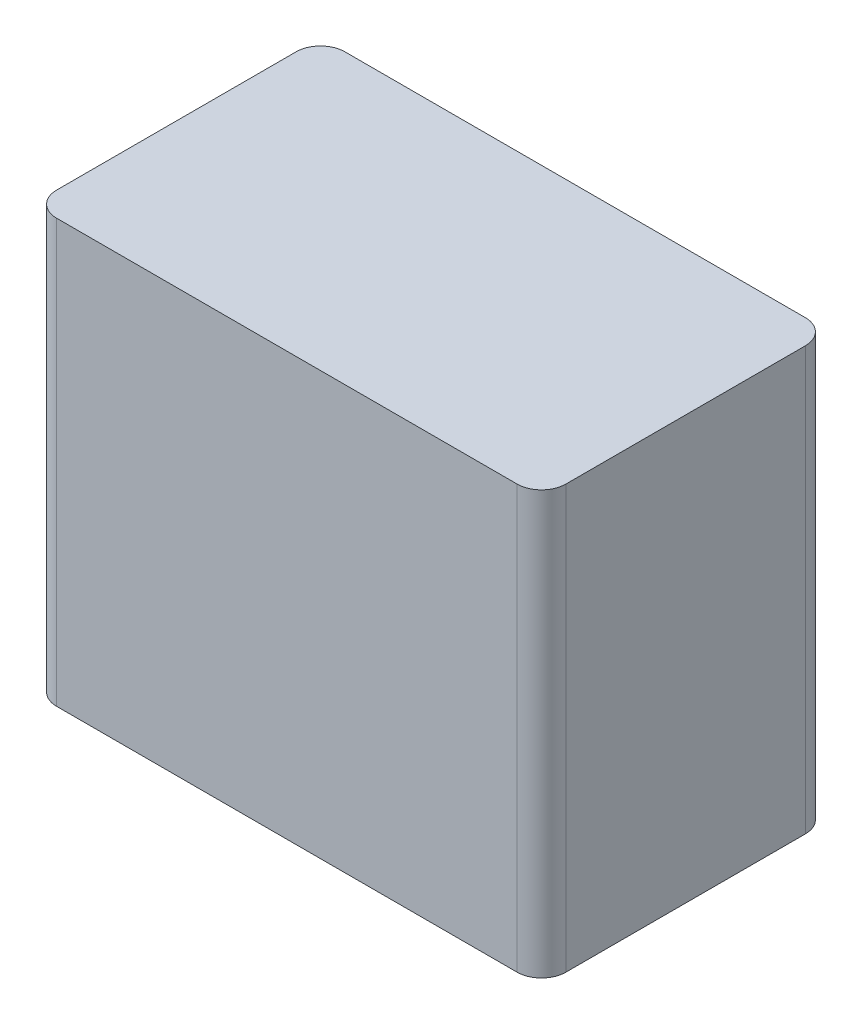
ISO-10303-21;
HEADER;
FILE_DESCRIPTION(('STEP AP214'),'2;1');
FILE_NAME('part.step','',(''),(''),'','','');
FILE_SCHEMA(('AUTOMOTIVE_DESIGN { 1 0 10303 214 1 1 1 1 }'));
ENDSEC;
DATA;
#1=APPLICATION_CONTEXT('core data for automotive mechanical design processes');
#2=APPLICATION_PROTOCOL_DEFINITION('international standard','automotive_design',2000,#1);
#3=PRODUCT_CONTEXT('',#1,'mechanical');
#4=PRODUCT('Part','Part','',(#3));
#5=PRODUCT_RELATED_PRODUCT_CATEGORY('part','',(#4));
#6=PRODUCT_DEFINITION_FORMATION('','',#4);
#7=PRODUCT_DEFINITION_CONTEXT('part definition',#1,'design');
#8=PRODUCT_DEFINITION('design','',#6,#7);
#9=PRODUCT_DEFINITION_SHAPE('','',#8);
#10=(LENGTH_UNIT() NAMED_UNIT(*) SI_UNIT(.MILLI.,.METRE.));
#11=(NAMED_UNIT(*) PLANE_ANGLE_UNIT() SI_UNIT($,.RADIAN.));
#12=(NAMED_UNIT(*) SI_UNIT($,.STERADIAN.) SOLID_ANGLE_UNIT());
#13=UNCERTAINTY_MEASURE_WITH_UNIT(LENGTH_MEASURE(1.E-05),#10,'distance_accuracy_value','');
#14=(GEOMETRIC_REPRESENTATION_CONTEXT(3) GLOBAL_UNCERTAINTY_ASSIGNED_CONTEXT((#13)) GLOBAL_UNIT_ASSIGNED_CONTEXT((#10,
#11,#12)) REPRESENTATION_CONTEXT('',''));
#15=CARTESIAN_POINT('',(0.,0.,0.));
#16=DIRECTION('',(0.,0.,1.));
#17=DIRECTION('',(1.,0.,0.));
#18=AXIS2_PLACEMENT_3D('',#15,#16,#17);
#19=CARTESIAN_POINT('',(0.,0.,30.));
#20=DIRECTION('',(-1.,0.,0.));
#21=DIRECTION('',(0.,0.,1.));
#22=AXIS2_PLACEMENT_3D('',#19,#20,#21);
#23=PLANE('',#22);
#24=DIRECTION('',(0.,0.,-1.));
#25=VECTOR('',#24,1.);
#26=CARTESIAN_POINT('',(0.,0.,30.));
#27=LINE('',#26,#25);
#28=CARTESIAN_POINT('',(0.,0.,27.46));
#29=VERTEX_POINT('',#28);
#30=CARTESIAN_POINT('',(0.,0.,2.54));
#31=VERTEX_POINT('',#30);
#32=EDGE_CURVE('E121',#29,#31,#27,.T.);
#33=ORIENTED_EDGE('',*,*,#32,.T.);
#34=DIRECTION('',(0.,1.,0.));
#35=VECTOR('',#34,1.);
#36=CARTESIAN_POINT('',(0.,0.,2.54));
#37=LINE('',#36,#35);
#38=CARTESIAN_POINT('',(0.,44.,2.54));
#39=VERTEX_POINT('',#38);
#40=EDGE_CURVE('E11',#31,#39,#37,.T.);
#41=ORIENTED_EDGE('',*,*,#40,.T.);
#42=DIRECTION('',(0.,0.,-1.));
#43=VECTOR('',#42,1.);
#44=CARTESIAN_POINT('',(0.,44.,30.));
#45=LINE('',#44,#43);
#46=CARTESIAN_POINT('',(0.,44.,27.46));
#47=VERTEX_POINT('',#46);
#48=EDGE_CURVE('E126',#47,#39,#45,.T.);
#49=ORIENTED_EDGE('',*,*,#48,.F.);
#50=DIRECTION('',(0.,1.,0.));
#51=VECTOR('',#50,1.);
#52=CARTESIAN_POINT('',(0.,0.,27.46));
#53=LINE('',#52,#51);
#54=EDGE_CURVE('E41',#47,#29,#53,.F.);
#55=ORIENTED_EDGE('',*,*,#54,.T.);
#56=EDGE_LOOP('',(#33,#41,#49,#55));
#57=FACE_BOUND('',#56,.T.);
#58=ADVANCED_FACE('F33',(#57),#23,.F.);
#59=CARTESIAN_POINT('',(0.,44.,30.));
#60=DIRECTION('',(0.,-1.,0.));
#61=DIRECTION('',(1.,0.,0.));
#62=AXIS2_PLACEMENT_3D('',#59,#60,#61);
#63=PLANE('',#62);
#64=DIRECTION('',(-1.,0.,0.));
#65=VECTOR('',#64,1.);
#66=CARTESIAN_POINT('',(0.,44.,0.));
#67=LINE('',#66,#65);
#68=CARTESIAN_POINT('',(-2.54,44.,0.));
#69=VERTEX_POINT('',#68);
#70=CARTESIAN_POINT('',(-50.46,44.,0.));
#71=VERTEX_POINT('',#70);
#72=EDGE_CURVE('E168',#69,#71,#67,.T.);
#73=ORIENTED_EDGE('',*,*,#72,.T.);
#74=CARTESIAN_POINT('',(-50.46,44.,2.54));
#75=DIRECTION('',(0.,-1.,0.));
#76=DIRECTION('',(1.,0.,0.));
#77=AXIS2_PLACEMENT_3D('',#74,#75,#76);
#78=CIRCLE('',#77,2.54);
#79=CARTESIAN_POINT('',(-53.,44.,2.54));
#80=VERTEX_POINT('',#79);
#81=EDGE_CURVE('E143',#71,#80,#78,.F.);
#82=ORIENTED_EDGE('',*,*,#81,.T.);
#83=DIRECTION('',(0.,0.,-1.));
#84=VECTOR('',#83,1.);
#85=CARTESIAN_POINT('',(-53.,44.,30.));
#86=LINE('',#85,#84);
#87=CARTESIAN_POINT('',(-53.,44.,27.46));
#88=VERTEX_POINT('',#87);
#89=EDGE_CURVE('E120',#88,#80,#86,.T.);
#90=ORIENTED_EDGE('',*,*,#89,.F.);
#91=CARTESIAN_POINT('',(-50.46,44.,27.46));
#92=DIRECTION('',(0.,-1.,0.));
#93=DIRECTION('',(1.,0.,0.));
#94=AXIS2_PLACEMENT_3D('',#91,#92,#93);
#95=CIRCLE('',#94,2.54);
#96=CARTESIAN_POINT('',(-50.46,44.,30.));
#97=VERTEX_POINT('',#96);
#98=EDGE_CURVE('E125',#88,#97,#95,.F.);
#99=ORIENTED_EDGE('',*,*,#98,.T.);
#100=DIRECTION('',(-1.,0.,0.));
#101=VECTOR('',#100,1.);
#102=CARTESIAN_POINT('',(0.,44.,30.));
#103=LINE('',#102,#101);
#104=CARTESIAN_POINT('',(-2.54,44.,30.));
#105=VERTEX_POINT('',#104);
#106=EDGE_CURVE('E162',#105,#97,#103,.T.);
#107=ORIENTED_EDGE('',*,*,#106,.F.);
#108=CARTESIAN_POINT('',(-2.54,44.,27.46));
#109=DIRECTION('',(0.,-1.,0.));
#110=DIRECTION('',(1.,0.,0.));
#111=AXIS2_PLACEMENT_3D('',#108,#109,#110);
#112=CIRCLE('',#111,2.54);
#113=EDGE_CURVE('E55',#105,#47,#112,.F.);
#114=ORIENTED_EDGE('',*,*,#113,.T.);
#115=ORIENTED_EDGE('',*,*,#48,.T.);
#116=CARTESIAN_POINT('',(-2.54,44.,2.54));
#117=DIRECTION('',(0.,-1.,0.));
#118=DIRECTION('',(1.,0.,0.));
#119=AXIS2_PLACEMENT_3D('',#116,#117,#118);
#120=CIRCLE('',#119,2.54);
#121=EDGE_CURVE('E48',#39,#69,#120,.F.);
#122=ORIENTED_EDGE('',*,*,#121,.T.);
#123=EDGE_LOOP('',(#73,#82,#90,#99,#107,#114,#115,#122));
#124=FACE_BOUND('',#123,.T.);
#125=ADVANCED_FACE('F164',(#124),#63,.F.);
#126=CARTESIAN_POINT('',(-53.,0.,30.));
#127=DIRECTION('',(1.,0.,0.));
#128=DIRECTION('',(0.,0.,-1.));
#129=AXIS2_PLACEMENT_3D('',#126,#127,#128);
#130=PLANE('',#129);
#131=ORIENTED_EDGE('',*,*,#89,.T.);
#132=DIRECTION('',(0.,-1.,0.));
#133=VECTOR('',#132,1.);
#134=CARTESIAN_POINT('',(-53.,0.,2.54));
#135=LINE('',#134,#133);
#136=CARTESIAN_POINT('',(-53.,0.,2.54));
#137=VERTEX_POINT('',#136);
#138=EDGE_CURVE('E119',#80,#137,#135,.T.);
#139=ORIENTED_EDGE('',*,*,#138,.T.);
#140=DIRECTION('',(0.,0.,-1.));
#141=VECTOR('',#140,1.);
#142=CARTESIAN_POINT('',(-53.,0.,30.));
#143=LINE('',#142,#141);
#144=CARTESIAN_POINT('',(-53.,0.,27.46));
#145=VERTEX_POINT('',#144);
#146=EDGE_CURVE('E102',#145,#137,#143,.T.);
#147=ORIENTED_EDGE('',*,*,#146,.F.);
#148=DIRECTION('',(0.,-1.,0.));
#149=VECTOR('',#148,1.);
#150=CARTESIAN_POINT('',(-53.,44.,27.46));
#151=LINE('',#150,#149);
#152=EDGE_CURVE('E116',#145,#88,#151,.F.);
#153=ORIENTED_EDGE('',*,*,#152,.T.);
#154=EDGE_LOOP('',(#131,#139,#147,#153));
#155=FACE_BOUND('',#154,.T.);
#156=ADVANCED_FACE('F115',(#155),#130,.F.);
#157=CARTESIAN_POINT('',(0.,0.,30.));
#158=DIRECTION('',(0.,1.,0.));
#159=DIRECTION('',(0.,0.,1.));
#160=AXIS2_PLACEMENT_3D('',#157,#158,#159);
#161=PLANE('',#160);
#162=ORIENTED_EDGE('',*,*,#146,.T.);
#163=CARTESIAN_POINT('',(-50.46,0.,2.54));
#164=DIRECTION('',(0.,1.,0.));
#165=DIRECTION('',(0.,0.,1.));
#166=AXIS2_PLACEMENT_3D('',#163,#164,#165);
#167=CIRCLE('',#166,2.54);
#168=CARTESIAN_POINT('',(-50.46,0.,0.));
#169=VERTEX_POINT('',#168);
#170=EDGE_CURVE('E109',#137,#169,#167,.F.);
#171=ORIENTED_EDGE('',*,*,#170,.T.);
#172=DIRECTION('',(1.,0.,0.));
#173=VECTOR('',#172,1.);
#174=CARTESIAN_POINT('',(0.,0.,0.));
#175=LINE('',#174,#173);
#176=CARTESIAN_POINT('',(-2.54,0.,0.));
#177=VERTEX_POINT('',#176);
#178=EDGE_CURVE('E165',#169,#177,#175,.T.);
#179=ORIENTED_EDGE('',*,*,#178,.T.);
#180=CARTESIAN_POINT('',(-2.54,0.,2.54));
#181=DIRECTION('',(0.,1.,0.));
#182=DIRECTION('',(0.,0.,1.));
#183=AXIS2_PLACEMENT_3D('',#180,#181,#182);
#184=CIRCLE('',#183,2.54);
#185=EDGE_CURVE('E110',#177,#31,#184,.F.);
#186=ORIENTED_EDGE('',*,*,#185,.T.);
#187=ORIENTED_EDGE('',*,*,#32,.F.);
#188=CARTESIAN_POINT('',(-2.54,0.,27.46));
#189=DIRECTION('',(0.,1.,0.));
#190=DIRECTION('',(0.,0.,1.));
#191=AXIS2_PLACEMENT_3D('',#188,#189,#190);
#192=CIRCLE('',#191,2.54);
#193=CARTESIAN_POINT('',(-2.54,0.,30.));
#194=VERTEX_POINT('',#193);
#195=EDGE_CURVE('E128',#29,#194,#192,.F.);
#196=ORIENTED_EDGE('',*,*,#195,.T.);
#197=DIRECTION('',(1.,0.,0.));
#198=VECTOR('',#197,1.);
#199=CARTESIAN_POINT('',(0.,0.,30.));
#200=LINE('',#199,#198);
#201=CARTESIAN_POINT('',(-50.46,0.,30.));
#202=VERTEX_POINT('',#201);
#203=EDGE_CURVE('E104',#202,#194,#200,.T.);
#204=ORIENTED_EDGE('',*,*,#203,.F.);
#205=CARTESIAN_POINT('',(-50.46,0.,27.46));
#206=DIRECTION('',(0.,1.,0.));
#207=DIRECTION('',(0.,0.,1.));
#208=AXIS2_PLACEMENT_3D('',#205,#206,#207);
#209=CIRCLE('',#208,2.54);
#210=EDGE_CURVE('E99',#202,#145,#209,.F.);
#211=ORIENTED_EDGE('',*,*,#210,.T.);
#212=EDGE_LOOP('',(#162,#171,#179,#186,#187,#196,#204,#211));
#213=FACE_BOUND('',#212,.T.);
#214=ADVANCED_FACE('F101',(#213),#161,.F.);
#215=CARTESIAN_POINT('',(0.,0.,30.));
#216=DIRECTION('',(0.,0.,1.));
#217=DIRECTION('',(1.,0.,0.));
#218=AXIS2_PLACEMENT_3D('',#215,#216,#217);
#219=PLANE('',#218);
#220=ORIENTED_EDGE('',*,*,#106,.T.);
#221=DIRECTION('',(0.,-1.,0.));
#222=VECTOR('',#221,1.);
#223=CARTESIAN_POINT('',(-50.46,0.,30.));
#224=LINE('',#223,#222);
#225=EDGE_CURVE('E148',#97,#202,#224,.T.);
#226=ORIENTED_EDGE('',*,*,#225,.T.);
#227=ORIENTED_EDGE('',*,*,#203,.T.);
#228=DIRECTION('',(0.,1.,0.));
#229=VECTOR('',#228,1.);
#230=CARTESIAN_POINT('',(-2.54,44.,30.));
#231=LINE('',#230,#229);
#232=EDGE_CURVE('E145',#194,#105,#231,.T.);
#233=ORIENTED_EDGE('',*,*,#232,.T.);
#234=EDGE_LOOP('',(#220,#226,#227,#233));
#235=FACE_BOUND('',#234,.T.);
#236=ADVANCED_FACE('F161',(#235),#219,.T.);
#237=CARTESIAN_POINT('',(0.,0.,0.));
#238=DIRECTION('',(0.,0.,1.));
#239=DIRECTION('',(1.,0.,0.));
#240=AXIS2_PLACEMENT_3D('',#237,#238,#239);
#241=PLANE('',#240);
#242=ORIENTED_EDGE('',*,*,#178,.F.);
#243=DIRECTION('',(0.,-1.,0.));
#244=VECTOR('',#243,1.);
#245=CARTESIAN_POINT('',(-50.46,0.,0.));
#246=LINE('',#245,#244);
#247=EDGE_CURVE('E138',#169,#71,#246,.F.);
#248=ORIENTED_EDGE('',*,*,#247,.T.);
#249=ORIENTED_EDGE('',*,*,#72,.F.);
#250=DIRECTION('',(0.,1.,0.));
#251=VECTOR('',#250,1.);
#252=CARTESIAN_POINT('',(-2.54,0.,0.));
#253=LINE('',#252,#251);
#254=EDGE_CURVE('E136',#69,#177,#253,.F.);
#255=ORIENTED_EDGE('',*,*,#254,.T.);
#256=EDGE_LOOP('',(#242,#248,#249,#255));
#257=FACE_BOUND('',#256,.T.);
#258=ADVANCED_FACE('F177',(#257),#241,.F.);
#259=CARTESIAN_POINT('',(-50.46,0.,2.54));
#260=DIRECTION('',(0.,-1.,0.));
#261=DIRECTION('',(0.,0.,-1.));
#262=AXIS2_PLACEMENT_3D('',#259,#260,#261);
#263=CYLINDRICAL_SURFACE('',#262,2.54);
#264=ORIENTED_EDGE('',*,*,#81,.F.);
#265=ORIENTED_EDGE('',*,*,#247,.F.);
#266=ORIENTED_EDGE('',*,*,#170,.F.);
#267=ORIENTED_EDGE('',*,*,#138,.F.);
#268=EDGE_LOOP('',(#264,#265,#266,#267));
#269=FACE_BOUND('',#268,.T.);
#270=ADVANCED_FACE('F173',(#269),#263,.T.);
#271=CARTESIAN_POINT('',(-50.46,0.,27.46));
#272=DIRECTION('',(0.,1.,0.));
#273=DIRECTION('',(0.,0.,1.));
#274=AXIS2_PLACEMENT_3D('',#271,#272,#273);
#275=CYLINDRICAL_SURFACE('',#274,2.54);
#276=ORIENTED_EDGE('',*,*,#98,.F.);
#277=ORIENTED_EDGE('',*,*,#152,.F.);
#278=ORIENTED_EDGE('',*,*,#210,.F.);
#279=ORIENTED_EDGE('',*,*,#225,.F.);
#280=EDGE_LOOP('',(#276,#277,#278,#279));
#281=FACE_BOUND('',#280,.T.);
#282=ADVANCED_FACE('F124',(#281),#275,.T.);
#283=CARTESIAN_POINT('',(-2.54,0.,2.54));
#284=DIRECTION('',(0.,1.,0.));
#285=DIRECTION('',(0.,0.,1.));
#286=AXIS2_PLACEMENT_3D('',#283,#284,#285);
#287=CYLINDRICAL_SURFACE('',#286,2.54);
#288=ORIENTED_EDGE('',*,*,#185,.F.);
#289=ORIENTED_EDGE('',*,*,#254,.F.);
#290=ORIENTED_EDGE('',*,*,#121,.F.);
#291=ORIENTED_EDGE('',*,*,#40,.F.);
#292=EDGE_LOOP('',(#288,#289,#290,#291));
#293=FACE_BOUND('',#292,.T.);
#294=ADVANCED_FACE('F179',(#293),#287,.T.);
#295=CARTESIAN_POINT('',(-2.54,0.,27.46));
#296=DIRECTION('',(0.,-1.,0.));
#297=DIRECTION('',(0.,0.,-1.));
#298=AXIS2_PLACEMENT_3D('',#295,#296,#297);
#299=CYLINDRICAL_SURFACE('',#298,2.54);
#300=ORIENTED_EDGE('',*,*,#195,.F.);
#301=ORIENTED_EDGE('',*,*,#54,.F.);
#302=ORIENTED_EDGE('',*,*,#113,.F.);
#303=ORIENTED_EDGE('',*,*,#232,.F.);
#304=EDGE_LOOP('',(#300,#301,#302,#303));
#305=FACE_BOUND('',#304,.T.);
#306=ADVANCED_FACE('F35',(#305),#299,.T.);
#307=CLOSED_SHELL('',(#58,#125,#156,#214,#236,#258,#270,#282,#294,#306));
#308=MANIFOLD_SOLID_BREP('B2',#307);
#309=ADVANCED_BREP_SHAPE_REPRESENTATION('',(#18,#308),#14);
#310=SHAPE_DEFINITION_REPRESENTATION(#9,#309);
ENDSEC;
END-ISO-10303-21;
